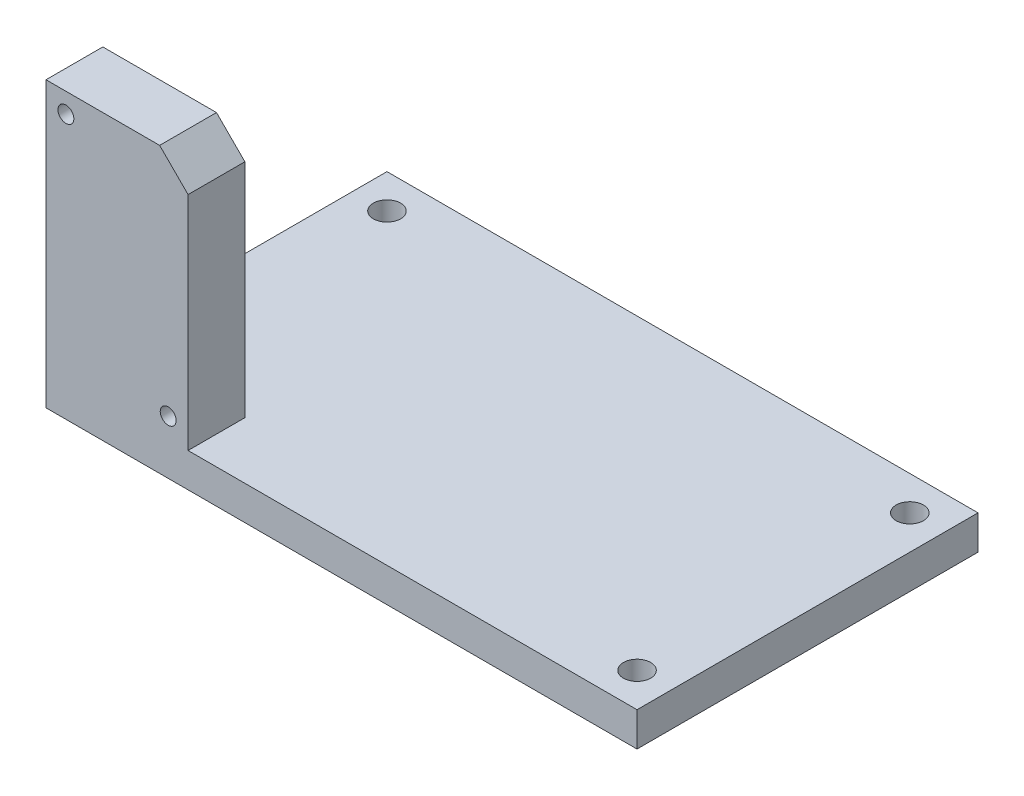
ISO-10303-21;
HEADER;
FILE_DESCRIPTION(('STEP AP214'),'2;1');
FILE_NAME('part.step','',(''),(''),'','','');
FILE_SCHEMA(('AUTOMOTIVE_DESIGN { 1 0 10303 214 1 1 1 1 }'));
ENDSEC;
DATA;
#1=APPLICATION_CONTEXT('core data for automotive mechanical design processes');
#2=APPLICATION_PROTOCOL_DEFINITION('international standard','automotive_design',2000,#1);
#3=PRODUCT_CONTEXT('',#1,'mechanical');
#4=PRODUCT('Part','Part','',(#3));
#5=PRODUCT_RELATED_PRODUCT_CATEGORY('part','',(#4));
#6=PRODUCT_DEFINITION_FORMATION('','',#4);
#7=PRODUCT_DEFINITION_CONTEXT('part definition',#1,'design');
#8=PRODUCT_DEFINITION('design','',#6,#7);
#9=PRODUCT_DEFINITION_SHAPE('','',#8);
#10=(LENGTH_UNIT() NAMED_UNIT(*) SI_UNIT(.MILLI.,.METRE.));
#11=(NAMED_UNIT(*) PLANE_ANGLE_UNIT() SI_UNIT($,.RADIAN.));
#12=(NAMED_UNIT(*) SI_UNIT($,.STERADIAN.) SOLID_ANGLE_UNIT());
#13=UNCERTAINTY_MEASURE_WITH_UNIT(LENGTH_MEASURE(1.E-05),#10,'distance_accuracy_value','');
#14=(GEOMETRIC_REPRESENTATION_CONTEXT(3) GLOBAL_UNCERTAINTY_ASSIGNED_CONTEXT((#13)) GLOBAL_UNIT_ASSIGNED_CONTEXT((#10,
#11,#12)) REPRESENTATION_CONTEXT('',''));
#15=CARTESIAN_POINT('',(0.,0.,0.));
#16=DIRECTION('',(0.,0.,1.));
#17=DIRECTION('',(1.,0.,0.));
#18=AXIS2_PLACEMENT_3D('',#15,#16,#17);
#19=CARTESIAN_POINT('',(0.,6.,0.));
#20=DIRECTION('',(0.,-1.,0.));
#21=DIRECTION('',(0.,0.,-1.));
#22=AXIS2_PLACEMENT_3D('',#19,#20,#21);
#23=PLANE('',#22);
#24=DIRECTION('',(0.,0.,1.));
#25=VECTOR('',#24,1.);
#26=CARTESIAN_POINT('',(-6.,6.,6.));
#27=LINE('',#26,#25);
#28=CARTESIAN_POINT('',(-6.,6.,-54.));
#29=VERTEX_POINT('',#28);
#30=CARTESIAN_POINT('',(-6.,6.,-4.));
#31=VERTEX_POINT('',#30);
#32=EDGE_CURVE('E114',#29,#31,#27,.T.);
#33=ORIENTED_EDGE('',*,*,#32,.T.);
#34=DIRECTION('',(1.,0.,0.));
#35=VECTOR('',#34,1.);
#36=CARTESIAN_POINT('',(-6.,6.,-4.));
#37=LINE('',#36,#35);
#38=CARTESIAN_POINT('',(19.,6.,-4.));
#39=VERTEX_POINT('',#38);
#40=EDGE_CURVE('E98',#31,#39,#37,.T.);
#41=ORIENTED_EDGE('',*,*,#40,.T.);
#42=DIRECTION('',(0.,0.,1.));
#43=VECTOR('',#42,1.);
#44=CARTESIAN_POINT('',(19.,6.,-4.));
#45=LINE('',#44,#43);
#46=CARTESIAN_POINT('',(19.,6.,6.));
#47=VERTEX_POINT('',#46);
#48=EDGE_CURVE('E178',#39,#47,#45,.T.);
#49=ORIENTED_EDGE('',*,*,#48,.T.);
#50=DIRECTION('',(1.,0.,0.));
#51=VECTOR('',#50,1.);
#52=CARTESIAN_POINT('',(-6.,6.,6.));
#53=LINE('',#52,#51);
#54=CARTESIAN_POINT('',(98.,6.,6.));
#55=VERTEX_POINT('',#54);
#56=EDGE_CURVE('E124',#47,#55,#53,.T.);
#57=ORIENTED_EDGE('',*,*,#56,.T.);
#58=DIRECTION('',(0.,0.,-1.));
#59=VECTOR('',#58,1.);
#60=CARTESIAN_POINT('',(98.,6.,6.));
#61=LINE('',#60,#59);
#62=CARTESIAN_POINT('',(98.,6.,-54.));
#63=VERTEX_POINT('',#62);
#64=EDGE_CURVE('E127',#55,#63,#61,.T.);
#65=ORIENTED_EDGE('',*,*,#64,.T.);
#66=DIRECTION('',(-1.,0.,0.));
#67=VECTOR('',#66,1.);
#68=CARTESIAN_POINT('',(-6.,6.,-54.));
#69=LINE('',#68,#67);
#70=EDGE_CURVE('E122',#63,#29,#69,.T.);
#71=ORIENTED_EDGE('',*,*,#70,.T.);
#72=EDGE_LOOP('',(#33,#41,#49,#57,#65,#71));
#73=FACE_BOUND('',#72,.T.);
#74=CARTESIAN_POINT('',(0.,6.,-48.));
#75=DIRECTION('',(0.,1.,0.));
#76=DIRECTION('',(0.,0.,1.));
#77=AXIS2_PLACEMENT_3D('',#74,#75,#76);
#78=CIRCLE('',#77,2.4);
#79=CARTESIAN_POINT('',(0.,6.,-45.6));
#80=VERTEX_POINT('',#79);
#81=EDGE_CURVE('E141',#80,#80,#78,.T.);
#82=ORIENTED_EDGE('',*,*,#81,.F.);
#83=EDGE_LOOP('',(#82));
#84=FACE_BOUND('',#83,.T.);
#85=CARTESIAN_POINT('',(92.,6.,-48.));
#86=DIRECTION('',(0.,1.,0.));
#87=DIRECTION('',(0.,0.,1.));
#88=AXIS2_PLACEMENT_3D('',#85,#86,#87);
#89=CIRCLE('',#88,2.4);
#90=CARTESIAN_POINT('',(92.,6.,-45.6));
#91=VERTEX_POINT('',#90);
#92=EDGE_CURVE('E192',#91,#91,#89,.T.);
#93=ORIENTED_EDGE('',*,*,#92,.F.);
#94=EDGE_LOOP('',(#93));
#95=FACE_BOUND('',#94,.T.);
#96=CARTESIAN_POINT('',(92.,6.,0.));
#97=DIRECTION('',(0.,1.,0.));
#98=DIRECTION('',(0.,0.,1.));
#99=AXIS2_PLACEMENT_3D('',#96,#97,#98);
#100=CIRCLE('',#99,2.4);
#101=CARTESIAN_POINT('',(92.,6.,2.4));
#102=VERTEX_POINT('',#101);
#103=EDGE_CURVE('E186',#102,#102,#100,.T.);
#104=ORIENTED_EDGE('',*,*,#103,.F.);
#105=EDGE_LOOP('',(#104));
#106=FACE_BOUND('',#105,.T.);
#107=ADVANCED_FACE('F34',(#73,#84,#95,#106),#23,.F.);
#108=CARTESIAN_POINT('',(0.,0.,0.));
#109=DIRECTION('',(0.,-1.,0.));
#110=DIRECTION('',(0.,0.,-1.));
#111=AXIS2_PLACEMENT_3D('',#108,#109,#110);
#112=PLANE('',#111);
#113=CARTESIAN_POINT('',(92.,0.,0.));
#114=DIRECTION('',(0.,1.,0.));
#115=DIRECTION('',(0.,0.,1.));
#116=AXIS2_PLACEMENT_3D('',#113,#114,#115);
#117=CIRCLE('',#116,2.4);
#118=CARTESIAN_POINT('',(92.,0.,2.4));
#119=VERTEX_POINT('',#118);
#120=EDGE_CURVE('E185',#119,#119,#117,.T.);
#121=ORIENTED_EDGE('',*,*,#120,.T.);
#122=EDGE_LOOP('',(#121));
#123=FACE_BOUND('',#122,.T.);
#124=CARTESIAN_POINT('',(0.,0.,-48.));
#125=DIRECTION('',(0.,1.,0.));
#126=DIRECTION('',(0.,0.,1.));
#127=AXIS2_PLACEMENT_3D('',#124,#125,#126);
#128=CIRCLE('',#127,2.4);
#129=CARTESIAN_POINT('',(0.,0.,-45.6));
#130=VERTEX_POINT('',#129);
#131=EDGE_CURVE('E132',#130,#130,#128,.T.);
#132=ORIENTED_EDGE('',*,*,#131,.T.);
#133=EDGE_LOOP('',(#132));
#134=FACE_BOUND('',#133,.T.);
#135=DIRECTION('',(0.,0.,1.));
#136=VECTOR('',#135,1.);
#137=CARTESIAN_POINT('',(-6.,0.,6.));
#138=LINE('',#137,#136);
#139=CARTESIAN_POINT('',(-6.,0.,-54.));
#140=VERTEX_POINT('',#139);
#141=CARTESIAN_POINT('',(-6.,0.,6.));
#142=VERTEX_POINT('',#141);
#143=EDGE_CURVE('E138',#140,#142,#138,.T.);
#144=ORIENTED_EDGE('',*,*,#143,.F.);
#145=DIRECTION('',(-1.,0.,0.));
#146=VECTOR('',#145,1.);
#147=CARTESIAN_POINT('',(-6.,0.,-54.));
#148=LINE('',#147,#146);
#149=CARTESIAN_POINT('',(98.,0.,-54.));
#150=VERTEX_POINT('',#149);
#151=EDGE_CURVE('E125',#150,#140,#148,.T.);
#152=ORIENTED_EDGE('',*,*,#151,.F.);
#153=DIRECTION('',(0.,0.,-1.));
#154=VECTOR('',#153,1.);
#155=CARTESIAN_POINT('',(98.,0.,6.));
#156=LINE('',#155,#154);
#157=CARTESIAN_POINT('',(98.,0.,6.));
#158=VERTEX_POINT('',#157);
#159=EDGE_CURVE('E129',#158,#150,#156,.T.);
#160=ORIENTED_EDGE('',*,*,#159,.F.);
#161=DIRECTION('',(1.,0.,0.));
#162=VECTOR('',#161,1.);
#163=CARTESIAN_POINT('',(-6.,0.,6.));
#164=LINE('',#163,#162);
#165=EDGE_CURVE('E140',#142,#158,#164,.T.);
#166=ORIENTED_EDGE('',*,*,#165,.F.);
#167=EDGE_LOOP('',(#144,#152,#160,#166));
#168=FACE_BOUND('',#167,.T.);
#169=CARTESIAN_POINT('',(92.,0.,-48.));
#170=DIRECTION('',(0.,1.,0.));
#171=DIRECTION('',(0.,0.,1.));
#172=AXIS2_PLACEMENT_3D('',#169,#170,#171);
#173=CIRCLE('',#172,2.4);
#174=CARTESIAN_POINT('',(92.,0.,-45.6));
#175=VERTEX_POINT('',#174);
#176=EDGE_CURVE('E189',#175,#175,#173,.T.);
#177=ORIENTED_EDGE('',*,*,#176,.T.);
#178=EDGE_LOOP('',(#177));
#179=FACE_BOUND('',#178,.T.);
#180=CARTESIAN_POINT('',(0.,0.,0.));
#181=DIRECTION('',(0.,1.,0.));
#182=DIRECTION('',(0.,0.,1.));
#183=AXIS2_PLACEMENT_3D('',#180,#181,#182);
#184=CIRCLE('',#183,2.4);
#185=CARTESIAN_POINT('',(0.,0.,2.4));
#186=VERTEX_POINT('',#185);
#187=EDGE_CURVE('E182',#186,#186,#184,.T.);
#188=ORIENTED_EDGE('',*,*,#187,.T.);
#189=EDGE_LOOP('',(#188));
#190=FACE_BOUND('',#189,.T.);
#191=ADVANCED_FACE('F202',(#123,#134,#168,#179,#190),#112,.T.);
#192=CARTESIAN_POINT('',(-6.,6.,6.));
#193=DIRECTION('',(1.,0.,0.));
#194=DIRECTION('',(0.,0.,-1.));
#195=AXIS2_PLACEMENT_3D('',#192,#193,#194);
#196=PLANE('',#195);
#197=ORIENTED_EDGE('',*,*,#143,.T.);
#198=DIRECTION('',(0.,-1.,0.));
#199=VECTOR('',#198,1.);
#200=CARTESIAN_POINT('',(-6.,6.,6.));
#201=LINE('',#200,#199);
#202=CARTESIAN_POINT('',(-6.,50.,6.));
#203=VERTEX_POINT('',#202);
#204=EDGE_CURVE('E151',#203,#142,#201,.T.);
#205=ORIENTED_EDGE('',*,*,#204,.F.);
#206=DIRECTION('',(0.,0.,1.));
#207=VECTOR('',#206,1.);
#208=CARTESIAN_POINT('',(-6.,50.,-4.));
#209=LINE('',#208,#207);
#210=CARTESIAN_POINT('',(-6.,50.,-4.));
#211=VERTEX_POINT('',#210);
#212=EDGE_CURVE('E117',#211,#203,#209,.T.);
#213=ORIENTED_EDGE('',*,*,#212,.F.);
#214=DIRECTION('',(0.,-1.,0.));
#215=VECTOR('',#214,1.);
#216=CARTESIAN_POINT('',(-6.,6.,-4.));
#217=LINE('',#216,#215);
#218=EDGE_CURVE('E101',#211,#31,#217,.T.);
#219=ORIENTED_EDGE('',*,*,#218,.T.);
#220=ORIENTED_EDGE('',*,*,#32,.F.);
#221=DIRECTION('',(0.,-1.,0.));
#222=VECTOR('',#221,1.);
#223=CARTESIAN_POINT('',(-6.,6.,-54.));
#224=LINE('',#223,#222);
#225=EDGE_CURVE('E137',#29,#140,#224,.T.);
#226=ORIENTED_EDGE('',*,*,#225,.T.);
#227=EDGE_LOOP('',(#197,#205,#213,#219,#220,#226));
#228=FACE_BOUND('',#227,.T.);
#229=ADVANCED_FACE('F112',(#228),#196,.F.);
#230=CARTESIAN_POINT('',(-6.,6.,6.));
#231=DIRECTION('',(0.,0.,-1.));
#232=DIRECTION('',(-1.,0.,0.));
#233=AXIS2_PLACEMENT_3D('',#230,#231,#232);
#234=PLANE('',#233);
#235=CARTESIAN_POINT('',(15.5,9.5,6.));
#236=DIRECTION('',(0.,0.,-1.));
#237=DIRECTION('',(-1.,0.,0.));
#238=AXIS2_PLACEMENT_3D('',#235,#236,#237);
#239=CIRCLE('',#238,1.4);
#240=CARTESIAN_POINT('',(14.1,9.5,6.));
#241=VERTEX_POINT('',#240);
#242=EDGE_CURVE('E166',#241,#241,#239,.T.);
#243=ORIENTED_EDGE('',*,*,#242,.T.);
#244=EDGE_LOOP('',(#243));
#245=FACE_BOUND('',#244,.T.);
#246=CARTESIAN_POINT('',(-2.5,46.5,6.));
#247=DIRECTION('',(0.,0.,-1.));
#248=DIRECTION('',(-1.,0.,0.));
#249=AXIS2_PLACEMENT_3D('',#246,#247,#248);
#250=CIRCLE('',#249,1.4);
#251=CARTESIAN_POINT('',(-3.9,46.5,6.));
#252=VERTEX_POINT('',#251);
#253=EDGE_CURVE('E370',#252,#252,#250,.T.);
#254=ORIENTED_EDGE('',*,*,#253,.T.);
#255=EDGE_LOOP('',(#254));
#256=FACE_BOUND('',#255,.T.);
#257=DIRECTION('',(0.,1.,0.));
#258=VECTOR('',#257,1.);
#259=CARTESIAN_POINT('',(19.,6.,6.));
#260=LINE('',#259,#258);
#261=CARTESIAN_POINT('',(19.,45.,6.));
#262=VERTEX_POINT('',#261);
#263=EDGE_CURVE('E160',#47,#262,#260,.T.);
#264=ORIENTED_EDGE('',*,*,#263,.T.);
#265=DIRECTION('',(0.707106781186549,-0.707106781186546,0.));
#266=VECTOR('',#265,1.);
#267=CARTESIAN_POINT('',(19.,45.,6.));
#268=LINE('',#267,#266);
#269=CARTESIAN_POINT('',(14.,50.,6.));
#270=VERTEX_POINT('',#269);
#271=EDGE_CURVE('E56',#262,#270,#268,.F.);
#272=ORIENTED_EDGE('',*,*,#271,.T.);
#273=DIRECTION('',(-1.,0.,0.));
#274=VECTOR('',#273,1.);
#275=CARTESIAN_POINT('',(-6.,50.,6.));
#276=LINE('',#275,#274);
#277=EDGE_CURVE('E118',#270,#203,#276,.T.);
#278=ORIENTED_EDGE('',*,*,#277,.T.);
#279=ORIENTED_EDGE('',*,*,#204,.T.);
#280=ORIENTED_EDGE('',*,*,#165,.T.);
#281=DIRECTION('',(0.,-1.,0.));
#282=VECTOR('',#281,1.);
#283=CARTESIAN_POINT('',(98.,6.,6.));
#284=LINE('',#283,#282);
#285=EDGE_CURVE('E148',#55,#158,#284,.T.);
#286=ORIENTED_EDGE('',*,*,#285,.F.);
#287=ORIENTED_EDGE('',*,*,#56,.F.);
#288=EDGE_LOOP('',(#264,#272,#278,#279,#280,#286,#287));
#289=FACE_BOUND('',#288,.T.);
#290=ADVANCED_FACE('F164',(#245,#256,#289),#234,.F.);
#291=CARTESIAN_POINT('',(98.,6.,6.));
#292=DIRECTION('',(-1.,0.,0.));
#293=DIRECTION('',(0.,0.,1.));
#294=AXIS2_PLACEMENT_3D('',#291,#292,#293);
#295=PLANE('',#294);
#296=ORIENTED_EDGE('',*,*,#159,.T.);
#297=DIRECTION('',(0.,-1.,0.));
#298=VECTOR('',#297,1.);
#299=CARTESIAN_POINT('',(98.,6.,-54.));
#300=LINE('',#299,#298);
#301=EDGE_CURVE('E145',#63,#150,#300,.T.);
#302=ORIENTED_EDGE('',*,*,#301,.F.);
#303=ORIENTED_EDGE('',*,*,#64,.F.);
#304=ORIENTED_EDGE('',*,*,#285,.T.);
#305=EDGE_LOOP('',(#296,#302,#303,#304));
#306=FACE_BOUND('',#305,.T.);
#307=ADVANCED_FACE('F217',(#306),#295,.F.);
#308=CARTESIAN_POINT('',(-6.,6.,-54.));
#309=DIRECTION('',(0.,0.,1.));
#310=DIRECTION('',(1.,0.,0.));
#311=AXIS2_PLACEMENT_3D('',#308,#309,#310);
#312=PLANE('',#311);
#313=ORIENTED_EDGE('',*,*,#151,.T.);
#314=ORIENTED_EDGE('',*,*,#225,.F.);
#315=ORIENTED_EDGE('',*,*,#70,.F.);
#316=ORIENTED_EDGE('',*,*,#301,.T.);
#317=EDGE_LOOP('',(#313,#314,#315,#316));
#318=FACE_BOUND('',#317,.T.);
#319=ADVANCED_FACE('F208',(#318),#312,.F.);
#320=CARTESIAN_POINT('',(0.,6.,-48.));
#321=DIRECTION('',(0.,-1.,0.));
#322=DIRECTION('',(0.,0.,-1.));
#323=AXIS2_PLACEMENT_3D('',#320,#321,#322);
#324=CYLINDRICAL_SURFACE('',#323,2.4);
#325=ORIENTED_EDGE('',*,*,#81,.T.);
#326=EDGE_LOOP('',(#325));
#327=FACE_BOUND('',#326,.T.);
#328=ORIENTED_EDGE('',*,*,#131,.F.);
#329=EDGE_LOOP('',(#328));
#330=FACE_BOUND('',#329,.T.);
#331=ADVANCED_FACE('F205',(#327,#330),#324,.F.);
#332=CARTESIAN_POINT('',(92.,6.,-48.));
#333=DIRECTION('',(0.,-1.,0.));
#334=DIRECTION('',(0.,0.,-1.));
#335=AXIS2_PLACEMENT_3D('',#332,#333,#334);
#336=CYLINDRICAL_SURFACE('',#335,2.4);
#337=ORIENTED_EDGE('',*,*,#92,.T.);
#338=EDGE_LOOP('',(#337));
#339=FACE_BOUND('',#338,.T.);
#340=ORIENTED_EDGE('',*,*,#176,.F.);
#341=EDGE_LOOP('',(#340));
#342=FACE_BOUND('',#341,.T.);
#343=ADVANCED_FACE('F207',(#339,#342),#336,.F.);
#344=CARTESIAN_POINT('',(92.,6.,0.));
#345=DIRECTION('',(0.,-1.,0.));
#346=DIRECTION('',(0.,0.,-1.));
#347=AXIS2_PLACEMENT_3D('',#344,#345,#346);
#348=CYLINDRICAL_SURFACE('',#347,2.4);
#349=ORIENTED_EDGE('',*,*,#103,.T.);
#350=EDGE_LOOP('',(#349));
#351=FACE_BOUND('',#350,.T.);
#352=ORIENTED_EDGE('',*,*,#120,.F.);
#353=EDGE_LOOP('',(#352));
#354=FACE_BOUND('',#353,.T.);
#355=ADVANCED_FACE('F214',(#351,#354),#348,.F.);
#356=CARTESIAN_POINT('',(0.,6.,0.));
#357=DIRECTION('',(0.,-1.,0.));
#358=DIRECTION('',(0.,0.,-1.));
#359=AXIS2_PLACEMENT_3D('',#356,#357,#358);
#360=CYLINDRICAL_SURFACE('',#359,2.4);
#361=CARTESIAN_POINT('',(0.,6.,0.));
#362=DIRECTION('',(0.,1.,0.));
#363=DIRECTION('',(0.,0.,1.));
#364=AXIS2_PLACEMENT_3D('',#361,#362,#363);
#365=CIRCLE('',#364,2.4);
#366=CARTESIAN_POINT('',(0.,6.,2.4));
#367=VERTEX_POINT('',#366);
#368=EDGE_CURVE('E177',#367,#367,#365,.T.);
#369=ORIENTED_EDGE('',*,*,#368,.T.);
#370=EDGE_LOOP('',(#369));
#371=FACE_BOUND('',#370,.T.);
#372=ORIENTED_EDGE('',*,*,#187,.F.);
#373=EDGE_LOOP('',(#372));
#374=FACE_BOUND('',#373,.T.);
#375=ADVANCED_FACE('F272',(#371,#374),#360,.F.);
#376=CARTESIAN_POINT('',(0.,0.,-4.));
#377=DIRECTION('',(0.,0.,-1.));
#378=DIRECTION('',(-1.,0.,0.));
#379=AXIS2_PLACEMENT_3D('',#376,#377,#378);
#380=PLANE('',#379);
#381=CARTESIAN_POINT('',(15.5,9.5,-4.));
#382=DIRECTION('',(0.,0.,-1.));
#383=DIRECTION('',(-1.,0.,0.));
#384=AXIS2_PLACEMENT_3D('',#381,#382,#383);
#385=CIRCLE('',#384,1.4);
#386=CARTESIAN_POINT('',(14.1,9.5,-4.));
#387=VERTEX_POINT('',#386);
#388=EDGE_CURVE('E170',#387,#387,#385,.T.);
#389=ORIENTED_EDGE('',*,*,#388,.F.);
#390=EDGE_LOOP('',(#389));
#391=FACE_BOUND('',#390,.T.);
#392=CARTESIAN_POINT('',(-2.5,46.5,-4.));
#393=DIRECTION('',(0.,0.,-1.));
#394=DIRECTION('',(-1.,0.,0.));
#395=AXIS2_PLACEMENT_3D('',#392,#393,#394);
#396=CIRCLE('',#395,1.4);
#397=CARTESIAN_POINT('',(-3.9,46.5,-4.));
#398=VERTEX_POINT('',#397);
#399=EDGE_CURVE('E367',#398,#398,#396,.T.);
#400=ORIENTED_EDGE('',*,*,#399,.F.);
#401=EDGE_LOOP('',(#400));
#402=FACE_BOUND('',#401,.T.);
#403=DIRECTION('',(-1.,0.,0.));
#404=VECTOR('',#403,1.);
#405=CARTESIAN_POINT('',(-6.,50.,-4.));
#406=LINE('',#405,#404);
#407=CARTESIAN_POINT('',(14.,50.,-4.));
#408=VERTEX_POINT('',#407);
#409=EDGE_CURVE('E173',#408,#211,#406,.T.);
#410=ORIENTED_EDGE('',*,*,#409,.F.);
#411=DIRECTION('',(-0.707106781186549,0.707106781186546,0.));
#412=VECTOR('',#411,1.);
#413=CARTESIAN_POINT('',(32.,32.,-4.));
#414=LINE('',#413,#412);
#415=CARTESIAN_POINT('',(19.,45.,-4.));
#416=VERTEX_POINT('',#415);
#417=EDGE_CURVE('E11',#408,#416,#414,.F.);
#418=ORIENTED_EDGE('',*,*,#417,.T.);
#419=DIRECTION('',(0.,1.,0.));
#420=VECTOR('',#419,1.);
#421=CARTESIAN_POINT('',(19.,6.,-4.));
#422=LINE('',#421,#420);
#423=EDGE_CURVE('E103',#39,#416,#422,.T.);
#424=ORIENTED_EDGE('',*,*,#423,.F.);
#425=ORIENTED_EDGE('',*,*,#40,.F.);
#426=ORIENTED_EDGE('',*,*,#218,.F.);
#427=EDGE_LOOP('',(#410,#418,#424,#425,#426));
#428=FACE_BOUND('',#427,.T.);
#429=ADVANCED_FACE('F100',(#391,#402,#428),#380,.T.);
#430=CARTESIAN_POINT('',(19.,6.,-4.));
#431=DIRECTION('',(1.,0.,0.));
#432=DIRECTION('',(0.,0.,-1.));
#433=AXIS2_PLACEMENT_3D('',#430,#431,#432);
#434=PLANE('',#433);
#435=ORIENTED_EDGE('',*,*,#423,.T.);
#436=DIRECTION('',(0.,0.,1.));
#437=VECTOR('',#436,1.);
#438=CARTESIAN_POINT('',(19.,45.,-4.));
#439=LINE('',#438,#437);
#440=EDGE_CURVE('E154',#416,#262,#439,.T.);
#441=ORIENTED_EDGE('',*,*,#440,.T.);
#442=ORIENTED_EDGE('',*,*,#263,.F.);
#443=ORIENTED_EDGE('',*,*,#48,.F.);
#444=EDGE_LOOP('',(#435,#441,#442,#443));
#445=FACE_BOUND('',#444,.T.);
#446=ADVANCED_FACE('F159',(#445),#434,.T.);
#447=CARTESIAN_POINT('',(-6.,50.,-4.));
#448=DIRECTION('',(0.,1.,0.));
#449=DIRECTION('',(0.,0.,1.));
#450=AXIS2_PLACEMENT_3D('',#447,#448,#449);
#451=PLANE('',#450);
#452=ORIENTED_EDGE('',*,*,#277,.F.);
#453=DIRECTION('',(0.,0.,-1.));
#454=VECTOR('',#453,1.);
#455=CARTESIAN_POINT('',(14.,50.,-4.));
#456=LINE('',#455,#454);
#457=EDGE_CURVE('E42',#270,#408,#456,.T.);
#458=ORIENTED_EDGE('',*,*,#457,.T.);
#459=ORIENTED_EDGE('',*,*,#409,.T.);
#460=ORIENTED_EDGE('',*,*,#212,.T.);
#461=EDGE_LOOP('',(#452,#458,#459,#460));
#462=FACE_BOUND('',#461,.T.);
#463=ADVANCED_FACE('F319',(#462),#451,.T.);
#464=CARTESIAN_POINT('',(-6.,6.,-4.));
#465=DIRECTION('',(0.,-1.,0.));
#466=DIRECTION('',(0.,0.,-1.));
#467=AXIS2_PLACEMENT_3D('',#464,#465,#466);
#468=PLANE('',#467);
#469=ORIENTED_EDGE('',*,*,#368,.F.);
#470=EDGE_LOOP('',(#469));
#471=FACE_BOUND('',#470,.T.);
#472=ADVANCED_FACE('F327',(#471),#468,.T.);
#473=CARTESIAN_POINT('',(-2.5,46.5,6.));
#474=DIRECTION('',(0.,0.,-1.));
#475=DIRECTION('',(-1.,0.,0.));
#476=AXIS2_PLACEMENT_3D('',#473,#474,#475);
#477=CYLINDRICAL_SURFACE('',#476,1.4);
#478=ORIENTED_EDGE('',*,*,#253,.F.);
#479=EDGE_LOOP('',(#478));
#480=FACE_BOUND('',#479,.T.);
#481=ORIENTED_EDGE('',*,*,#399,.T.);
#482=EDGE_LOOP('',(#481));
#483=FACE_BOUND('',#482,.T.);
#484=ADVANCED_FACE('F335',(#480,#483),#477,.F.);
#485=CARTESIAN_POINT('',(15.5,9.5,6.));
#486=DIRECTION('',(0.,0.,-1.));
#487=DIRECTION('',(-1.,0.,0.));
#488=AXIS2_PLACEMENT_3D('',#485,#486,#487);
#489=CYLINDRICAL_SURFACE('',#488,1.4);
#490=ORIENTED_EDGE('',*,*,#242,.F.);
#491=EDGE_LOOP('',(#490));
#492=FACE_BOUND('',#491,.T.);
#493=ORIENTED_EDGE('',*,*,#388,.T.);
#494=EDGE_LOOP('',(#493));
#495=FACE_BOUND('',#494,.T.);
#496=ADVANCED_FACE('F344',(#492,#495),#489,.F.);
#497=CARTESIAN_POINT('',(19.,45.,-4.));
#498=DIRECTION('',(-0.707106781186546,-0.707106781186549,0.));
#499=DIRECTION('',(0.,0.,1.));
#500=AXIS2_PLACEMENT_3D('',#497,#498,#499);
#501=PLANE('',#500);
#502=ORIENTED_EDGE('',*,*,#417,.F.);
#503=ORIENTED_EDGE('',*,*,#457,.F.);
#504=ORIENTED_EDGE('',*,*,#271,.F.);
#505=ORIENTED_EDGE('',*,*,#440,.F.);
#506=EDGE_LOOP('',(#502,#503,#504,#505));
#507=FACE_BOUND('',#506,.T.);
#508=ADVANCED_FACE('F36',(#507),#501,.F.);
#509=CLOSED_SHELL('',(#107,#191,#229,#290,#307,#319,#331,#343,#355,#375,#429,#446,#463,#472,
#484,#496,#508));
#510=MANIFOLD_SOLID_BREP('B2',#509);
#511=ADVANCED_BREP_SHAPE_REPRESENTATION('',(#18,#510),#14);
#512=SHAPE_DEFINITION_REPRESENTATION(#9,#511);
ENDSEC;
END-ISO-10303-21;
